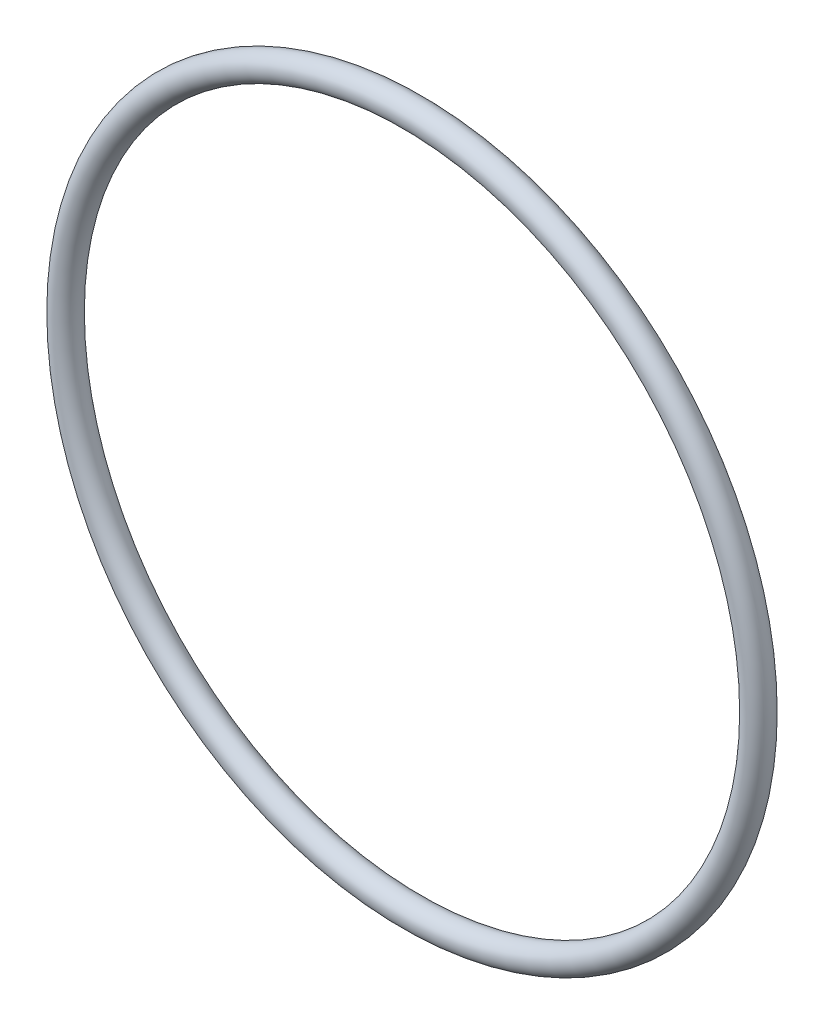
ISO-10303-21;
HEADER;
FILE_DESCRIPTION(('STEP AP214'),'2;1');
FILE_NAME('part.step','',(''),(''),'','','');
FILE_SCHEMA(('AUTOMOTIVE_DESIGN { 1 0 10303 214 1 1 1 1 }'));
ENDSEC;
DATA;
#1=APPLICATION_CONTEXT('core data for automotive mechanical design processes');
#2=APPLICATION_PROTOCOL_DEFINITION('international standard','automotive_design',2000,#1);
#3=PRODUCT_CONTEXT('',#1,'mechanical');
#4=PRODUCT('Part','Part','',(#3));
#5=PRODUCT_RELATED_PRODUCT_CATEGORY('part','',(#4));
#6=PRODUCT_DEFINITION_FORMATION('','',#4);
#7=PRODUCT_DEFINITION_CONTEXT('part definition',#1,'design');
#8=PRODUCT_DEFINITION('design','',#6,#7);
#9=PRODUCT_DEFINITION_SHAPE('','',#8);
#10=(LENGTH_UNIT() NAMED_UNIT(*) SI_UNIT(.MILLI.,.METRE.));
#11=(NAMED_UNIT(*) PLANE_ANGLE_UNIT() SI_UNIT($,.RADIAN.));
#12=(NAMED_UNIT(*) SI_UNIT($,.STERADIAN.) SOLID_ANGLE_UNIT());
#13=UNCERTAINTY_MEASURE_WITH_UNIT(LENGTH_MEASURE(1.E-05),#10,'distance_accuracy_value','');
#14=(GEOMETRIC_REPRESENTATION_CONTEXT(3) GLOBAL_UNCERTAINTY_ASSIGNED_CONTEXT((#13)) GLOBAL_UNIT_ASSIGNED_CONTEXT((#10,
#11,#12)) REPRESENTATION_CONTEXT('',''));
#15=CARTESIAN_POINT('',(0.,0.,0.));
#16=DIRECTION('',(0.,0.,1.));
#17=DIRECTION('',(1.,0.,0.));
#18=AXIS2_PLACEMENT_3D('',#15,#16,#17);
#19=CARTESIAN_POINT('',(0.,0.,0.));
#20=DIRECTION('',(0.,0.,1.));
#21=DIRECTION('',(1.,0.,0.));
#22=AXIS2_PLACEMENT_3D('',#19,#20,#21);
#23=TOROIDAL_SURFACE('',#22,46.0121,1.76530000000001);
#24=CARTESIAN_POINT('',(47.7774,0.,0.));
#25=VERTEX_POINT('',#24);
#26=VERTEX_LOOP('',#25);
#27=FACE_BOUND('',#26,.T.);
#28=ADVANCED_FACE('F30',(#27),#23,.T.);
#29=CLOSED_SHELL('',(#28));
#30=MANIFOLD_SOLID_BREP('B2',#29);
#31=ADVANCED_BREP_SHAPE_REPRESENTATION('',(#18,#30),#14);
#32=SHAPE_DEFINITION_REPRESENTATION(#9,#31);
ENDSEC;
END-ISO-10303-21;
